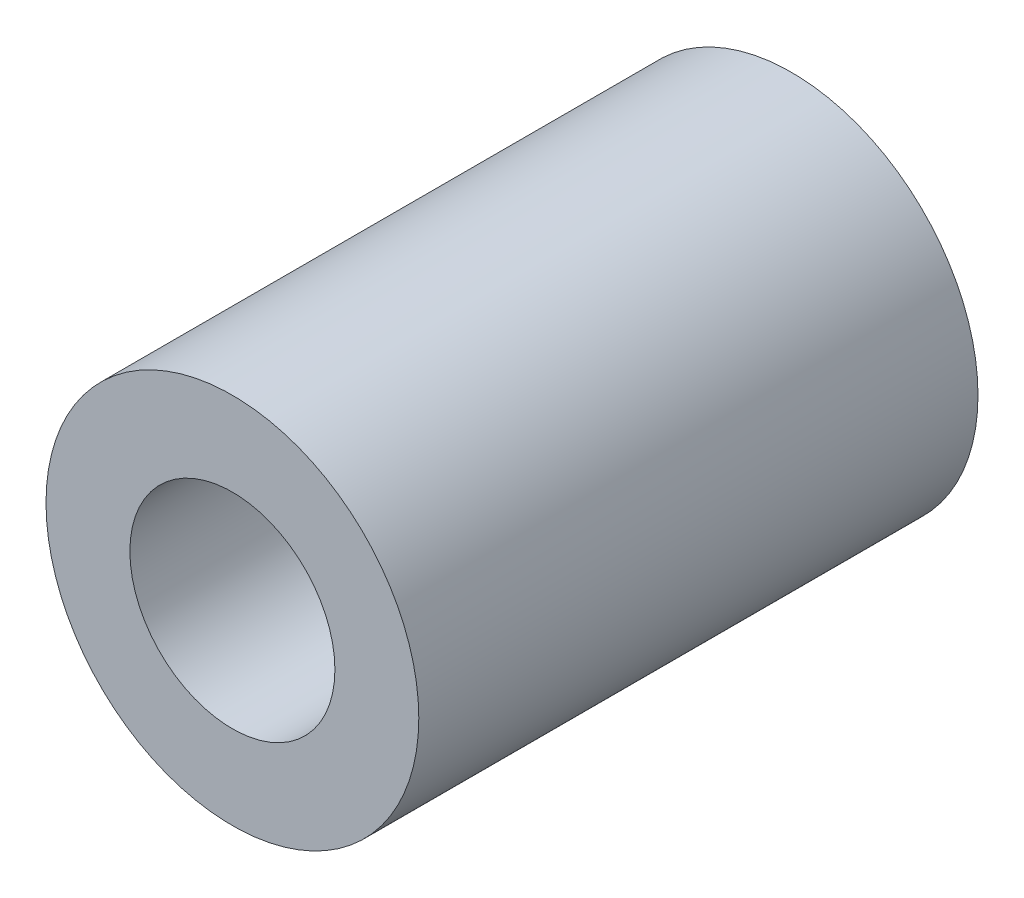
ISO-10303-21;
HEADER;
FILE_DESCRIPTION(('STEP AP214'),'2;1');
FILE_NAME('part.step','',(''),(''),'','','');
FILE_SCHEMA(('AUTOMOTIVE_DESIGN { 1 0 10303 214 1 1 1 1 }'));
ENDSEC;
DATA;
#1=APPLICATION_CONTEXT('core data for automotive mechanical design processes');
#2=APPLICATION_PROTOCOL_DEFINITION('international standard','automotive_design',2000,#1);
#3=PRODUCT_CONTEXT('',#1,'mechanical');
#4=PRODUCT('Part','Part','',(#3));
#5=PRODUCT_RELATED_PRODUCT_CATEGORY('part','',(#4));
#6=PRODUCT_DEFINITION_FORMATION('','',#4);
#7=PRODUCT_DEFINITION_CONTEXT('part definition',#1,'design');
#8=PRODUCT_DEFINITION('design','',#6,#7);
#9=PRODUCT_DEFINITION_SHAPE('','',#8);
#10=(LENGTH_UNIT() NAMED_UNIT(*) SI_UNIT(.MILLI.,.METRE.));
#11=(NAMED_UNIT(*) PLANE_ANGLE_UNIT() SI_UNIT($,.RADIAN.));
#12=(NAMED_UNIT(*) SI_UNIT($,.STERADIAN.) SOLID_ANGLE_UNIT());
#13=UNCERTAINTY_MEASURE_WITH_UNIT(LENGTH_MEASURE(1.E-05),#10,'distance_accuracy_value','');
#14=(GEOMETRIC_REPRESENTATION_CONTEXT(3) GLOBAL_UNCERTAINTY_ASSIGNED_CONTEXT((#13)) GLOBAL_UNIT_ASSIGNED_CONTEXT((#10,
#11,#12)) REPRESENTATION_CONTEXT('',''));
#15=CARTESIAN_POINT('',(0.,0.,0.));
#16=DIRECTION('',(0.,0.,1.));
#17=DIRECTION('',(1.,0.,0.));
#18=AXIS2_PLACEMENT_3D('',#15,#16,#17);
#19=CARTESIAN_POINT('',(0.,0.,6.));
#20=DIRECTION('',(0.,0.,1.));
#21=DIRECTION('',(1.,0.,0.));
#22=AXIS2_PLACEMENT_3D('',#19,#20,#21);
#23=PLANE('',#22);
#24=CARTESIAN_POINT('',(0.,0.,6.));
#25=DIRECTION('',(0.,0.,1.));
#26=DIRECTION('',(1.,0.,0.));
#27=AXIS2_PLACEMENT_3D('',#24,#25,#26);
#28=CIRCLE('',#27,2.);
#29=CARTESIAN_POINT('',(2.,0.,6.));
#30=VERTEX_POINT('',#29);
#31=EDGE_CURVE('E10',#30,#30,#28,.T.);
#32=ORIENTED_EDGE('',*,*,#31,.T.);
#33=EDGE_LOOP('',(#32));
#34=FACE_BOUND('',#33,.T.);
#35=CARTESIAN_POINT('',(0.,0.,6.));
#36=DIRECTION('',(0.,0.,1.));
#37=DIRECTION('',(1.,0.,0.));
#38=AXIS2_PLACEMENT_3D('',#35,#36,#37);
#39=CIRCLE('',#38,1.1);
#40=CARTESIAN_POINT('',(1.1,0.,6.));
#41=VERTEX_POINT('',#40);
#42=EDGE_CURVE('E43',#41,#41,#39,.T.);
#43=ORIENTED_EDGE('',*,*,#42,.F.);
#44=EDGE_LOOP('',(#43));
#45=FACE_BOUND('',#44,.T.);
#46=ADVANCED_FACE('F32',(#34,#45),#23,.T.);
#47=CARTESIAN_POINT('',(0.,0.,0.));
#48=DIRECTION('',(0.,0.,1.));
#49=DIRECTION('',(1.,0.,0.));
#50=AXIS2_PLACEMENT_3D('',#47,#48,#49);
#51=PLANE('',#50);
#52=CARTESIAN_POINT('',(0.,0.,0.));
#53=DIRECTION('',(0.,0.,1.));
#54=DIRECTION('',(1.,0.,0.));
#55=AXIS2_PLACEMENT_3D('',#52,#53,#54);
#56=CIRCLE('',#55,2.);
#57=CARTESIAN_POINT('',(2.,0.,0.));
#58=VERTEX_POINT('',#57);
#59=EDGE_CURVE('E36',#58,#58,#56,.T.);
#60=ORIENTED_EDGE('',*,*,#59,.F.);
#61=EDGE_LOOP('',(#60));
#62=FACE_BOUND('',#61,.T.);
#63=CARTESIAN_POINT('',(0.,0.,0.));
#64=DIRECTION('',(0.,0.,1.));
#65=DIRECTION('',(1.,0.,0.));
#66=AXIS2_PLACEMENT_3D('',#63,#64,#65);
#67=CIRCLE('',#66,1.1);
#68=CARTESIAN_POINT('',(1.1,0.,0.));
#69=VERTEX_POINT('',#68);
#70=EDGE_CURVE('E45',#69,#69,#67,.T.);
#71=ORIENTED_EDGE('',*,*,#70,.T.);
#72=EDGE_LOOP('',(#71));
#73=FACE_BOUND('',#72,.T.);
#74=ADVANCED_FACE('F55',(#62,#73),#51,.F.);
#75=CARTESIAN_POINT('',(0.,0.,6.));
#76=DIRECTION('',(0.,0.,-1.));
#77=DIRECTION('',(-1.,0.,0.));
#78=AXIS2_PLACEMENT_3D('',#75,#76,#77);
#79=CYLINDRICAL_SURFACE('',#78,2.);
#80=ORIENTED_EDGE('',*,*,#31,.F.);
#81=EDGE_LOOP('',(#80));
#82=FACE_BOUND('',#81,.T.);
#83=ORIENTED_EDGE('',*,*,#59,.T.);
#84=EDGE_LOOP('',(#83));
#85=FACE_BOUND('',#84,.T.);
#86=ADVANCED_FACE('F34',(#82,#85),#79,.T.);
#87=CARTESIAN_POINT('',(0.,0.,6.));
#88=DIRECTION('',(0.,0.,-1.));
#89=DIRECTION('',(-1.,0.,0.));
#90=AXIS2_PLACEMENT_3D('',#87,#88,#89);
#91=CYLINDRICAL_SURFACE('',#90,1.1);
#92=ORIENTED_EDGE('',*,*,#42,.T.);
#93=EDGE_LOOP('',(#92));
#94=FACE_BOUND('',#93,.T.);
#95=ORIENTED_EDGE('',*,*,#70,.F.);
#96=EDGE_LOOP('',(#95));
#97=FACE_BOUND('',#96,.T.);
#98=ADVANCED_FACE('F51',(#94,#97),#91,.F.);
#99=CLOSED_SHELL('',(#46,#74,#86,#98));
#100=MANIFOLD_SOLID_BREP('B2',#99);
#101=ADVANCED_BREP_SHAPE_REPRESENTATION('',(#18,#100),#14);
#102=SHAPE_DEFINITION_REPRESENTATION(#9,#101);
ENDSEC;
END-ISO-10303-21;
